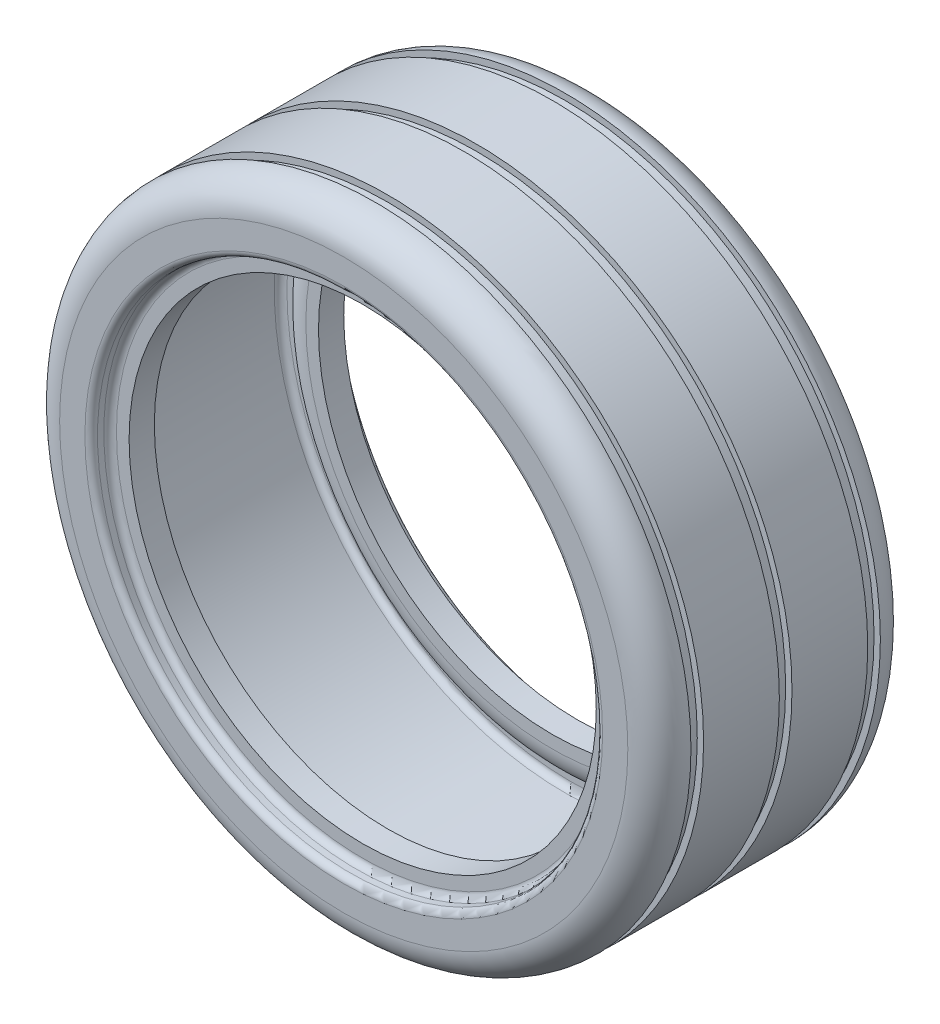
ISO-10303-21;
HEADER;
FILE_DESCRIPTION(('STEP AP214'),'2;1');
FILE_NAME('part.step','',(''),(''),'','','');
FILE_SCHEMA(('AUTOMOTIVE_DESIGN { 1 0 10303 214 1 1 1 1 }'));
ENDSEC;
DATA;
#1=APPLICATION_CONTEXT('core data for automotive mechanical design processes');
#2=APPLICATION_PROTOCOL_DEFINITION('international standard','automotive_design',2000,#1);
#3=PRODUCT_CONTEXT('',#1,'mechanical');
#4=PRODUCT('Part','Part','',(#3));
#5=PRODUCT_RELATED_PRODUCT_CATEGORY('part','',(#4));
#6=PRODUCT_DEFINITION_FORMATION('','',#4);
#7=PRODUCT_DEFINITION_CONTEXT('part definition',#1,'design');
#8=PRODUCT_DEFINITION('design','',#6,#7);
#9=PRODUCT_DEFINITION_SHAPE('','',#8);
#10=(LENGTH_UNIT() NAMED_UNIT(*) SI_UNIT(.MILLI.,.METRE.));
#11=(NAMED_UNIT(*) PLANE_ANGLE_UNIT() SI_UNIT($,.RADIAN.));
#12=(NAMED_UNIT(*) SI_UNIT($,.STERADIAN.) SOLID_ANGLE_UNIT());
#13=UNCERTAINTY_MEASURE_WITH_UNIT(LENGTH_MEASURE(1.E-05),#10,'distance_accuracy_value','');
#14=(GEOMETRIC_REPRESENTATION_CONTEXT(3) GLOBAL_UNCERTAINTY_ASSIGNED_CONTEXT((#13)) GLOBAL_UNIT_ASSIGNED_CONTEXT((#10,
#11,#12)) REPRESENTATION_CONTEXT('',''));
#15=CARTESIAN_POINT('',(0.,0.,0.));
#16=DIRECTION('',(0.,0.,1.));
#17=DIRECTION('',(1.,0.,0.));
#18=AXIS2_PLACEMENT_3D('',#15,#16,#17);
#19=CARTESIAN_POINT('',(0.,80.,-19.));
#20=DIRECTION('',(0.,0.,1.));
#21=DIRECTION('',(1.,0.,0.));
#22=AXIS2_PLACEMENT_3D('',#19,#20,#21);
#23=TOROIDAL_SURFACE('',#22,41.,1.);
#24=CARTESIAN_POINT('',(0.,80.,-20.));
#25=DIRECTION('',(0.,0.,1.));
#26=DIRECTION('',(1.,0.,0.));
#27=AXIS2_PLACEMENT_3D('',#24,#25,#26);
#28=CIRCLE('',#27,41.);
#29=CARTESIAN_POINT('',(41.,80.,-20.));
#30=VERTEX_POINT('',#29);
#31=EDGE_CURVE('E10',#30,#30,#28,.T.);
#32=ORIENTED_EDGE('',*,*,#31,.F.);
#33=EDGE_LOOP('',(#32));
#34=FACE_BOUND('',#33,.T.);
#35=CARTESIAN_POINT('',(0.,80.,-19.));
#36=DIRECTION('',(0.,0.,1.));
#37=DIRECTION('',(1.,0.,0.));
#38=AXIS2_PLACEMENT_3D('',#35,#36,#37);
#39=CIRCLE('',#38,40.);
#40=CARTESIAN_POINT('',(40.,80.,-19.));
#41=VERTEX_POINT('',#40);
#42=EDGE_CURVE('E67',#41,#41,#39,.T.);
#43=ORIENTED_EDGE('',*,*,#42,.T.);
#44=EDGE_LOOP('',(#43));
#45=FACE_BOUND('',#44,.T.);
#46=ADVANCED_FACE('F35',(#34,#45),#23,.T.);
#47=CARTESIAN_POINT('',(0.,125.,-20.));
#48=DIRECTION('',(0.,0.,1.));
#49=DIRECTION('',(1.,0.,0.));
#50=AXIS2_PLACEMENT_3D('',#47,#48,#49);
#51=PLANE('',#50);
#52=CARTESIAN_POINT('',(0.,80.,-20.));
#53=DIRECTION('',(0.,0.,1.));
#54=DIRECTION('',(1.,0.,0.));
#55=AXIS2_PLACEMENT_3D('',#52,#53,#54);
#56=CIRCLE('',#55,45.);
#57=CARTESIAN_POINT('',(45.,80.,-20.));
#58=VERTEX_POINT('',#57);
#59=EDGE_CURVE('E42',#58,#58,#56,.T.);
#60=ORIENTED_EDGE('',*,*,#59,.F.);
#61=EDGE_LOOP('',(#60));
#62=FACE_BOUND('',#61,.T.);
#63=ORIENTED_EDGE('',*,*,#31,.T.);
#64=EDGE_LOOP('',(#63));
#65=FACE_BOUND('',#64,.T.);
#66=ADVANCED_FACE('F190',(#62,#65),#51,.F.);
#67=CARTESIAN_POINT('',(0.,80.,-15.));
#68=DIRECTION('',(0.,0.,1.));
#69=DIRECTION('',(1.,0.,0.));
#70=AXIS2_PLACEMENT_3D('',#67,#68,#69);
#71=TOROIDAL_SURFACE('',#70,45.,5.);
#72=CARTESIAN_POINT('',(0.,80.,-15.));
#73=DIRECTION('',(0.,0.,-1.));
#74=DIRECTION('',(-1.,0.,0.));
#75=AXIS2_PLACEMENT_3D('',#72,#73,#74);
#76=CIRCLE('',#75,50.);
#77=CARTESIAN_POINT('',(-50.,80.,-15.));
#78=VERTEX_POINT('',#77);
#79=EDGE_CURVE('E59',#78,#78,#76,.T.);
#80=ORIENTED_EDGE('',*,*,#79,.T.);
#81=EDGE_LOOP('',(#80));
#82=FACE_BOUND('',#81,.T.);
#83=ORIENTED_EDGE('',*,*,#59,.T.);
#84=EDGE_LOOP('',(#83));
#85=FACE_BOUND('',#84,.T.);
#86=ADVANCED_FACE('F134',(#82,#85),#71,.T.);
#87=CARTESIAN_POINT('',(0.,80.,15.));
#88=DIRECTION('',(0.,0.,1.));
#89=DIRECTION('',(1.,0.,0.));
#90=AXIS2_PLACEMENT_3D('',#87,#88,#89);
#91=TOROIDAL_SURFACE('',#90,45.,5.);
#92=CARTESIAN_POINT('',(0.,80.,20.));
#93=DIRECTION('',(0.,0.,1.));
#94=DIRECTION('',(1.,0.,0.));
#95=AXIS2_PLACEMENT_3D('',#92,#93,#94);
#96=CIRCLE('',#95,45.);
#97=CARTESIAN_POINT('',(45.,80.,20.));
#98=VERTEX_POINT('',#97);
#99=EDGE_CURVE('E47',#98,#98,#96,.T.);
#100=ORIENTED_EDGE('',*,*,#99,.F.);
#101=EDGE_LOOP('',(#100));
#102=FACE_BOUND('',#101,.T.);
#103=CARTESIAN_POINT('',(0.,80.,15.));
#104=DIRECTION('',(0.,0.,1.));
#105=DIRECTION('',(1.,0.,0.));
#106=AXIS2_PLACEMENT_3D('',#103,#104,#105);
#107=CIRCLE('',#106,50.);
#108=CARTESIAN_POINT('',(50.,80.,15.));
#109=VERTEX_POINT('',#108);
#110=EDGE_CURVE('E55',#109,#109,#107,.T.);
#111=ORIENTED_EDGE('',*,*,#110,.T.);
#112=EDGE_LOOP('',(#111));
#113=FACE_BOUND('',#112,.T.);
#114=ADVANCED_FACE('F131',(#102,#113),#91,.T.);
#115=CARTESIAN_POINT('',(0.,125.,20.));
#116=DIRECTION('',(0.,0.,-1.));
#117=DIRECTION('',(-1.,0.,0.));
#118=AXIS2_PLACEMENT_3D('',#115,#116,#117);
#119=PLANE('',#118);
#120=CARTESIAN_POINT('',(0.,80.,20.));
#121=DIRECTION('',(0.,0.,1.));
#122=DIRECTION('',(1.,0.,0.));
#123=AXIS2_PLACEMENT_3D('',#120,#121,#122);
#124=CIRCLE('',#123,41.);
#125=CARTESIAN_POINT('',(41.,80.,20.));
#126=VERTEX_POINT('',#125);
#127=EDGE_CURVE('E124',#126,#126,#124,.T.);
#128=ORIENTED_EDGE('',*,*,#127,.F.);
#129=EDGE_LOOP('',(#128));
#130=FACE_BOUND('',#129,.T.);
#131=ORIENTED_EDGE('',*,*,#99,.T.);
#132=EDGE_LOOP('',(#131));
#133=FACE_BOUND('',#132,.T.);
#134=ADVANCED_FACE('F129',(#130,#133),#119,.F.);
#135=CARTESIAN_POINT('',(0.,80.,19.));
#136=DIRECTION('',(0.,0.,1.));
#137=DIRECTION('',(1.,0.,0.));
#138=AXIS2_PLACEMENT_3D('',#135,#136,#137);
#139=TOROIDAL_SURFACE('',#138,41.,1.);
#140=CARTESIAN_POINT('',(0.,80.,19.));
#141=DIRECTION('',(0.,0.,1.));
#142=DIRECTION('',(1.,0.,0.));
#143=AXIS2_PLACEMENT_3D('',#140,#141,#142);
#144=CIRCLE('',#143,40.);
#145=CARTESIAN_POINT('',(40.,80.,19.));
#146=VERTEX_POINT('',#145);
#147=EDGE_CURVE('E121',#146,#146,#144,.T.);
#148=ORIENTED_EDGE('',*,*,#147,.F.);
#149=EDGE_LOOP('',(#148));
#150=FACE_BOUND('',#149,.T.);
#151=ORIENTED_EDGE('',*,*,#127,.T.);
#152=EDGE_LOOP('',(#151));
#153=FACE_BOUND('',#152,.T.);
#154=ADVANCED_FACE('F299',(#150,#153),#139,.T.);
#155=CARTESIAN_POINT('',(0.,80.,0.));
#156=DIRECTION('',(0.,0.,1.));
#157=DIRECTION('',(1.,0.,0.));
#158=AXIS2_PLACEMENT_3D('',#155,#156,#157);
#159=CYLINDRICAL_SURFACE('',#158,40.);
#160=CARTESIAN_POINT('',(0.,80.,18.));
#161=DIRECTION('',(0.,0.,1.));
#162=DIRECTION('',(1.,0.,0.));
#163=AXIS2_PLACEMENT_3D('',#160,#161,#162);
#164=CIRCLE('',#163,40.);
#165=CARTESIAN_POINT('',(40.,80.,18.));
#166=VERTEX_POINT('',#165);
#167=EDGE_CURVE('E118',#166,#166,#164,.T.);
#168=ORIENTED_EDGE('',*,*,#167,.F.);
#169=EDGE_LOOP('',(#168));
#170=FACE_BOUND('',#169,.T.);
#171=ORIENTED_EDGE('',*,*,#147,.T.);
#172=EDGE_LOOP('',(#171));
#173=FACE_BOUND('',#172,.T.);
#174=ADVANCED_FACE('F293',(#170,#173),#159,.F.);
#175=CARTESIAN_POINT('',(0.,80.,18.));
#176=DIRECTION('',(0.,0.,1.));
#177=DIRECTION('',(1.,0.,0.));
#178=AXIS2_PLACEMENT_3D('',#175,#176,#177);
#179=TOROIDAL_SURFACE('',#178,39.,1.);
#180=CARTESIAN_POINT('',(0.,80.,17.));
#181=DIRECTION('',(0.,0.,1.));
#182=DIRECTION('',(1.,0.,0.));
#183=AXIS2_PLACEMENT_3D('',#180,#181,#182);
#184=CIRCLE('',#183,39.);
#185=CARTESIAN_POINT('',(39.,80.,17.));
#186=VERTEX_POINT('',#185);
#187=EDGE_CURVE('E115',#186,#186,#184,.T.);
#188=ORIENTED_EDGE('',*,*,#187,.F.);
#189=EDGE_LOOP('',(#188));
#190=FACE_BOUND('',#189,.T.);
#191=ORIENTED_EDGE('',*,*,#167,.T.);
#192=EDGE_LOOP('',(#191));
#193=FACE_BOUND('',#192,.T.);
#194=ADVANCED_FACE('F287',(#190,#193),#179,.F.);
#195=CARTESIAN_POINT('',(0.,119.,17.));
#196=DIRECTION('',(0.,0.,-1.));
#197=DIRECTION('',(-1.,0.,0.));
#198=AXIS2_PLACEMENT_3D('',#195,#196,#197);
#199=PLANE('',#198);
#200=CARTESIAN_POINT('',(0.,80.,17.));
#201=DIRECTION('',(0.,0.,1.));
#202=DIRECTION('',(1.,0.,0.));
#203=AXIS2_PLACEMENT_3D('',#200,#201,#202);
#204=CIRCLE('',#203,37.);
#205=CARTESIAN_POINT('',(37.,80.,17.));
#206=VERTEX_POINT('',#205);
#207=EDGE_CURVE('E112',#206,#206,#204,.T.);
#208=ORIENTED_EDGE('',*,*,#207,.F.);
#209=EDGE_LOOP('',(#208));
#210=FACE_BOUND('',#209,.T.);
#211=ORIENTED_EDGE('',*,*,#187,.T.);
#212=EDGE_LOOP('',(#211));
#213=FACE_BOUND('',#212,.T.);
#214=ADVANCED_FACE('F281',(#210,#213),#199,.F.);
#215=CARTESIAN_POINT('',(0.,80.,0.));
#216=DIRECTION('',(0.,0.,1.));
#217=DIRECTION('',(1.,0.,0.));
#218=AXIS2_PLACEMENT_3D('',#215,#216,#217);
#219=CYLINDRICAL_SURFACE('',#218,37.);
#220=CARTESIAN_POINT('',(0.,80.,13.));
#221=DIRECTION('',(0.,0.,1.));
#222=DIRECTION('',(1.,0.,0.));
#223=AXIS2_PLACEMENT_3D('',#220,#221,#222);
#224=CIRCLE('',#223,37.);
#225=CARTESIAN_POINT('',(37.,80.,13.));
#226=VERTEX_POINT('',#225);
#227=EDGE_CURVE('E109',#226,#226,#224,.T.);
#228=ORIENTED_EDGE('',*,*,#227,.F.);
#229=EDGE_LOOP('',(#228));
#230=FACE_BOUND('',#229,.T.);
#231=ORIENTED_EDGE('',*,*,#207,.T.);
#232=EDGE_LOOP('',(#231));
#233=FACE_BOUND('',#232,.T.);
#234=ADVANCED_FACE('F275',(#230,#233),#219,.F.);
#235=CARTESIAN_POINT('',(0.,119.,13.));
#236=DIRECTION('',(0.,0.,1.));
#237=DIRECTION('',(1.,0.,0.));
#238=AXIS2_PLACEMENT_3D('',#235,#236,#237);
#239=PLANE('',#238);
#240=CARTESIAN_POINT('',(0.,80.,13.));
#241=DIRECTION('',(0.,0.,1.));
#242=DIRECTION('',(1.,0.,0.));
#243=AXIS2_PLACEMENT_3D('',#240,#241,#242);
#244=CIRCLE('',#243,39.);
#245=CARTESIAN_POINT('',(39.,80.,13.));
#246=VERTEX_POINT('',#245);
#247=EDGE_CURVE('E106',#246,#246,#244,.T.);
#248=ORIENTED_EDGE('',*,*,#247,.F.);
#249=EDGE_LOOP('',(#248));
#250=FACE_BOUND('',#249,.T.);
#251=ORIENTED_EDGE('',*,*,#227,.T.);
#252=EDGE_LOOP('',(#251));
#253=FACE_BOUND('',#252,.T.);
#254=ADVANCED_FACE('F269',(#250,#253),#239,.F.);
#255=CARTESIAN_POINT('',(0.,80.,18.));
#256=DIRECTION('',(0.,0.,1.));
#257=DIRECTION('',(1.,0.,0.));
#258=AXIS2_PLACEMENT_3D('',#255,#256,#257);
#259=TOROIDAL_SURFACE('',#258,39.,5.);
#260=CARTESIAN_POINT('',(0.,80.,16.));
#261=DIRECTION('',(0.,0.,1.));
#262=DIRECTION('',(1.,0.,0.));
#263=AXIS2_PLACEMENT_3D('',#260,#261,#262);
#264=CIRCLE('',#263,43.5825756949558);
#265=CARTESIAN_POINT('',(43.5825756949558,80.,16.));
#266=VERTEX_POINT('',#265);
#267=EDGE_CURVE('E103',#266,#266,#264,.T.);
#268=ORIENTED_EDGE('',*,*,#267,.F.);
#269=EDGE_LOOP('',(#268));
#270=FACE_BOUND('',#269,.T.);
#271=ORIENTED_EDGE('',*,*,#247,.T.);
#272=EDGE_LOOP('',(#271));
#273=FACE_BOUND('',#272,.T.);
#274=ADVANCED_FACE('F263',(#270,#273),#259,.T.);
#275=CARTESIAN_POINT('',(0.,125.,16.));
#276=DIRECTION('',(0.,0.,1.));
#277=DIRECTION('',(1.,0.,0.));
#278=AXIS2_PLACEMENT_3D('',#275,#276,#277);
#279=PLANE('',#278);
#280=CARTESIAN_POINT('',(0.,80.,16.));
#281=DIRECTION('',(0.,0.,1.));
#282=DIRECTION('',(1.,0.,0.));
#283=AXIS2_PLACEMENT_3D('',#280,#281,#282);
#284=CIRCLE('',#283,45.);
#285=CARTESIAN_POINT('',(45.,80.,16.));
#286=VERTEX_POINT('',#285);
#287=EDGE_CURVE('E100',#286,#286,#284,.T.);
#288=ORIENTED_EDGE('',*,*,#287,.F.);
#289=EDGE_LOOP('',(#288));
#290=FACE_BOUND('',#289,.T.);
#291=ORIENTED_EDGE('',*,*,#267,.T.);
#292=EDGE_LOOP('',(#291));
#293=FACE_BOUND('',#292,.T.);
#294=ADVANCED_FACE('F257',(#290,#293),#279,.F.);
#295=CARTESIAN_POINT('',(0.,80.,15.));
#296=DIRECTION('',(0.,0.,1.));
#297=DIRECTION('',(1.,0.,0.));
#298=AXIS2_PLACEMENT_3D('',#295,#296,#297);
#299=TOROIDAL_SURFACE('',#298,45.,1.);
#300=CARTESIAN_POINT('',(0.,80.,15.));
#301=DIRECTION('',(0.,0.,1.));
#302=DIRECTION('',(1.,0.,0.));
#303=AXIS2_PLACEMENT_3D('',#300,#301,#302);
#304=CIRCLE('',#303,46.);
#305=CARTESIAN_POINT('',(46.,80.,15.));
#306=VERTEX_POINT('',#305);
#307=EDGE_CURVE('E97',#306,#306,#304,.T.);
#308=ORIENTED_EDGE('',*,*,#307,.F.);
#309=EDGE_LOOP('',(#308));
#310=FACE_BOUND('',#309,.T.);
#311=ORIENTED_EDGE('',*,*,#287,.T.);
#312=EDGE_LOOP('',(#311));
#313=FACE_BOUND('',#312,.T.);
#314=ADVANCED_FACE('F251',(#310,#313),#299,.F.);
#315=CARTESIAN_POINT('',(0.,80.,0.));
#316=DIRECTION('',(0.,0.,1.));
#317=DIRECTION('',(1.,0.,0.));
#318=AXIS2_PLACEMENT_3D('',#315,#316,#317);
#319=CYLINDRICAL_SURFACE('',#318,46.);
#320=CARTESIAN_POINT('',(0.,80.,-15.));
#321=DIRECTION('',(0.,0.,1.));
#322=DIRECTION('',(1.,0.,0.));
#323=AXIS2_PLACEMENT_3D('',#320,#321,#322);
#324=CIRCLE('',#323,46.);
#325=CARTESIAN_POINT('',(46.,80.,-15.));
#326=VERTEX_POINT('',#325);
#327=EDGE_CURVE('E94',#326,#326,#324,.T.);
#328=ORIENTED_EDGE('',*,*,#327,.F.);
#329=EDGE_LOOP('',(#328));
#330=FACE_BOUND('',#329,.T.);
#331=ORIENTED_EDGE('',*,*,#307,.T.);
#332=EDGE_LOOP('',(#331));
#333=FACE_BOUND('',#332,.T.);
#334=ADVANCED_FACE('F245',(#330,#333),#319,.F.);
#335=CARTESIAN_POINT('',(0.,80.,-15.));
#336=DIRECTION('',(0.,0.,1.));
#337=DIRECTION('',(1.,0.,0.));
#338=AXIS2_PLACEMENT_3D('',#335,#336,#337);
#339=TOROIDAL_SURFACE('',#338,45.,1.);
#340=CARTESIAN_POINT('',(0.,80.,-16.));
#341=DIRECTION('',(0.,0.,1.));
#342=DIRECTION('',(1.,0.,0.));
#343=AXIS2_PLACEMENT_3D('',#340,#341,#342);
#344=CIRCLE('',#343,45.);
#345=CARTESIAN_POINT('',(45.,80.,-16.));
#346=VERTEX_POINT('',#345);
#347=EDGE_CURVE('E91',#346,#346,#344,.T.);
#348=ORIENTED_EDGE('',*,*,#347,.F.);
#349=EDGE_LOOP('',(#348));
#350=FACE_BOUND('',#349,.T.);
#351=ORIENTED_EDGE('',*,*,#327,.T.);
#352=EDGE_LOOP('',(#351));
#353=FACE_BOUND('',#352,.T.);
#354=ADVANCED_FACE('F239',(#350,#353),#339,.F.);
#355=CARTESIAN_POINT('',(0.,125.,-16.));
#356=DIRECTION('',(0.,0.,-1.));
#357=DIRECTION('',(-1.,0.,0.));
#358=AXIS2_PLACEMENT_3D('',#355,#356,#357);
#359=PLANE('',#358);
#360=CARTESIAN_POINT('',(0.,80.,-16.));
#361=DIRECTION('',(0.,0.,1.));
#362=DIRECTION('',(1.,0.,0.));
#363=AXIS2_PLACEMENT_3D('',#360,#361,#362);
#364=CIRCLE('',#363,43.5825756949558);
#365=CARTESIAN_POINT('',(43.5825756949558,80.,-16.));
#366=VERTEX_POINT('',#365);
#367=EDGE_CURVE('E88',#366,#366,#364,.T.);
#368=ORIENTED_EDGE('',*,*,#367,.F.);
#369=EDGE_LOOP('',(#368));
#370=FACE_BOUND('',#369,.T.);
#371=ORIENTED_EDGE('',*,*,#347,.T.);
#372=EDGE_LOOP('',(#371));
#373=FACE_BOUND('',#372,.T.);
#374=ADVANCED_FACE('F233',(#370,#373),#359,.F.);
#375=CARTESIAN_POINT('',(0.,80.,-18.));
#376=DIRECTION('',(0.,0.,1.));
#377=DIRECTION('',(1.,0.,0.));
#378=AXIS2_PLACEMENT_3D('',#375,#376,#377);
#379=TOROIDAL_SURFACE('',#378,39.,5.);
#380=CARTESIAN_POINT('',(0.,80.,-13.));
#381=DIRECTION('',(0.,0.,1.));
#382=DIRECTION('',(1.,0.,0.));
#383=AXIS2_PLACEMENT_3D('',#380,#381,#382);
#384=CIRCLE('',#383,39.);
#385=CARTESIAN_POINT('',(39.,80.,-13.));
#386=VERTEX_POINT('',#385);
#387=EDGE_CURVE('E85',#386,#386,#384,.T.);
#388=ORIENTED_EDGE('',*,*,#387,.F.);
#389=EDGE_LOOP('',(#388));
#390=FACE_BOUND('',#389,.T.);
#391=ORIENTED_EDGE('',*,*,#367,.T.);
#392=EDGE_LOOP('',(#391));
#393=FACE_BOUND('',#392,.T.);
#394=ADVANCED_FACE('F227',(#390,#393),#379,.T.);
#395=CARTESIAN_POINT('',(0.,119.,-13.));
#396=DIRECTION('',(0.,0.,-1.));
#397=DIRECTION('',(-1.,0.,0.));
#398=AXIS2_PLACEMENT_3D('',#395,#396,#397);
#399=PLANE('',#398);
#400=CARTESIAN_POINT('',(0.,80.,-13.));
#401=DIRECTION('',(0.,0.,1.));
#402=DIRECTION('',(1.,0.,0.));
#403=AXIS2_PLACEMENT_3D('',#400,#401,#402);
#404=CIRCLE('',#403,37.);
#405=CARTESIAN_POINT('',(37.,80.,-13.));
#406=VERTEX_POINT('',#405);
#407=EDGE_CURVE('E82',#406,#406,#404,.T.);
#408=ORIENTED_EDGE('',*,*,#407,.F.);
#409=EDGE_LOOP('',(#408));
#410=FACE_BOUND('',#409,.T.);
#411=ORIENTED_EDGE('',*,*,#387,.T.);
#412=EDGE_LOOP('',(#411));
#413=FACE_BOUND('',#412,.T.);
#414=ADVANCED_FACE('F221',(#410,#413),#399,.F.);
#415=CARTESIAN_POINT('',(0.,80.,0.));
#416=DIRECTION('',(0.,0.,1.));
#417=DIRECTION('',(1.,0.,0.));
#418=AXIS2_PLACEMENT_3D('',#415,#416,#417);
#419=CYLINDRICAL_SURFACE('',#418,37.);
#420=CARTESIAN_POINT('',(0.,80.,-17.));
#421=DIRECTION('',(0.,0.,1.));
#422=DIRECTION('',(1.,0.,0.));
#423=AXIS2_PLACEMENT_3D('',#420,#421,#422);
#424=CIRCLE('',#423,37.);
#425=CARTESIAN_POINT('',(37.,80.,-17.));
#426=VERTEX_POINT('',#425);
#427=EDGE_CURVE('E79',#426,#426,#424,.T.);
#428=ORIENTED_EDGE('',*,*,#427,.F.);
#429=EDGE_LOOP('',(#428));
#430=FACE_BOUND('',#429,.T.);
#431=ORIENTED_EDGE('',*,*,#407,.T.);
#432=EDGE_LOOP('',(#431));
#433=FACE_BOUND('',#432,.T.);
#434=ADVANCED_FACE('F215',(#430,#433),#419,.F.);
#435=CARTESIAN_POINT('',(0.,119.,-17.));
#436=DIRECTION('',(0.,0.,1.));
#437=DIRECTION('',(1.,0.,0.));
#438=AXIS2_PLACEMENT_3D('',#435,#436,#437);
#439=PLANE('',#438);
#440=CARTESIAN_POINT('',(0.,80.,-17.));
#441=DIRECTION('',(0.,0.,1.));
#442=DIRECTION('',(1.,0.,0.));
#443=AXIS2_PLACEMENT_3D('',#440,#441,#442);
#444=CIRCLE('',#443,39.);
#445=CARTESIAN_POINT('',(39.,80.,-17.));
#446=VERTEX_POINT('',#445);
#447=EDGE_CURVE('E76',#446,#446,#444,.T.);
#448=ORIENTED_EDGE('',*,*,#447,.F.);
#449=EDGE_LOOP('',(#448));
#450=FACE_BOUND('',#449,.T.);
#451=ORIENTED_EDGE('',*,*,#427,.T.);
#452=EDGE_LOOP('',(#451));
#453=FACE_BOUND('',#452,.T.);
#454=ADVANCED_FACE('F209',(#450,#453),#439,.F.);
#455=CARTESIAN_POINT('',(0.,80.,-18.));
#456=DIRECTION('',(0.,0.,1.));
#457=DIRECTION('',(1.,0.,0.));
#458=AXIS2_PLACEMENT_3D('',#455,#456,#457);
#459=TOROIDAL_SURFACE('',#458,39.,1.);
#460=CARTESIAN_POINT('',(0.,80.,-18.));
#461=DIRECTION('',(0.,0.,1.));
#462=DIRECTION('',(1.,0.,0.));
#463=AXIS2_PLACEMENT_3D('',#460,#461,#462);
#464=CIRCLE('',#463,40.);
#465=CARTESIAN_POINT('',(40.,80.,-18.));
#466=VERTEX_POINT('',#465);
#467=EDGE_CURVE('E73',#466,#466,#464,.T.);
#468=ORIENTED_EDGE('',*,*,#467,.F.);
#469=EDGE_LOOP('',(#468));
#470=FACE_BOUND('',#469,.T.);
#471=ORIENTED_EDGE('',*,*,#447,.T.);
#472=EDGE_LOOP('',(#471));
#473=FACE_BOUND('',#472,.T.);
#474=ADVANCED_FACE('F203',(#470,#473),#459,.F.);
#475=CARTESIAN_POINT('',(0.,80.,0.));
#476=DIRECTION('',(0.,0.,1.));
#477=DIRECTION('',(1.,0.,0.));
#478=AXIS2_PLACEMENT_3D('',#475,#476,#477);
#479=CYLINDRICAL_SURFACE('',#478,40.);
#480=ORIENTED_EDGE('',*,*,#42,.F.);
#481=EDGE_LOOP('',(#480));
#482=FACE_BOUND('',#481,.T.);
#483=ORIENTED_EDGE('',*,*,#467,.T.);
#484=EDGE_LOOP('',(#483));
#485=FACE_BOUND('',#484,.T.);
#486=ADVANCED_FACE('F199',(#482,#485),#479,.F.);
#487=CARTESIAN_POINT('',(0.,142.18202290067,13.));
#488=DIRECTION('',(0.,0.,-1.));
#489=DIRECTION('',(-1.,0.,0.));
#490=AXIS2_PLACEMENT_3D('',#487,#488,#489);
#491=PLANE('',#490);
#492=CARTESIAN_POINT('',(0.,80.,13.));
#493=DIRECTION('',(0.,0.,-1.));
#494=DIRECTION('',(-1.,0.,0.));
#495=AXIS2_PLACEMENT_3D('',#492,#493,#494);
#496=CIRCLE('',#495,49.);
#497=CARTESIAN_POINT('',(-49.,80.,13.));
#498=VERTEX_POINT('',#497);
#499=EDGE_CURVE('E146',#498,#498,#496,.T.);
#500=ORIENTED_EDGE('',*,*,#499,.T.);
#501=EDGE_LOOP('',(#500));
#502=FACE_BOUND('',#501,.T.);
#503=CARTESIAN_POINT('',(0.,80.,13.));
#504=DIRECTION('',(0.,0.,-1.));
#505=DIRECTION('',(-1.,0.,0.));
#506=AXIS2_PLACEMENT_3D('',#503,#504,#505);
#507=CIRCLE('',#506,50.);
#508=CARTESIAN_POINT('',(-50.,80.,13.));
#509=VERTEX_POINT('',#508);
#510=EDGE_CURVE('E57',#509,#509,#507,.T.);
#511=ORIENTED_EDGE('',*,*,#510,.F.);
#512=EDGE_LOOP('',(#511));
#513=FACE_BOUND('',#512,.T.);
#514=ADVANCED_FACE('F202',(#502,#513),#491,.F.);
#515=CARTESIAN_POINT('',(0.,142.18202290067,15.));
#516=DIRECTION('',(0.,0.,1.));
#517=DIRECTION('',(1.,0.,0.));
#518=AXIS2_PLACEMENT_3D('',#515,#516,#517);
#519=PLANE('',#518);
#520=CARTESIAN_POINT('',(0.,80.,15.));
#521=DIRECTION('',(0.,0.,-1.));
#522=DIRECTION('',(-1.,0.,0.));
#523=AXIS2_PLACEMENT_3D('',#520,#521,#522);
#524=CIRCLE('',#523,49.);
#525=CARTESIAN_POINT('',(-49.,80.,15.));
#526=VERTEX_POINT('',#525);
#527=EDGE_CURVE('E149',#526,#526,#524,.T.);
#528=ORIENTED_EDGE('',*,*,#527,.F.);
#529=EDGE_LOOP('',(#528));
#530=FACE_BOUND('',#529,.T.);
#531=ORIENTED_EDGE('',*,*,#110,.F.);
#532=EDGE_LOOP('',(#531));
#533=FACE_BOUND('',#532,.T.);
#534=ADVANCED_FACE('F182',(#530,#533),#519,.F.);
#535=CARTESIAN_POINT('',(0.,80.,-15.));
#536=DIRECTION('',(0.,0.,-1.));
#537=DIRECTION('',(-1.,0.,0.));
#538=AXIS2_PLACEMENT_3D('',#535,#536,#537);
#539=CYLINDRICAL_SURFACE('',#538,49.);
#540=ORIENTED_EDGE('',*,*,#499,.F.);
#541=EDGE_LOOP('',(#540));
#542=FACE_BOUND('',#541,.T.);
#543=ORIENTED_EDGE('',*,*,#527,.T.);
#544=EDGE_LOOP('',(#543));
#545=FACE_BOUND('',#544,.T.);
#546=ADVANCED_FACE('F173',(#542,#545),#539,.T.);
#547=CARTESIAN_POINT('',(0.,80.,0.));
#548=DIRECTION('',(0.,0.,1.));
#549=DIRECTION('',(1.,0.,0.));
#550=AXIS2_PLACEMENT_3D('',#547,#548,#549);
#551=CYLINDRICAL_SURFACE('',#550,50.);
#552=ORIENTED_EDGE('',*,*,#510,.T.);
#553=EDGE_LOOP('',(#552));
#554=FACE_BOUND('',#553,.T.);
#555=CARTESIAN_POINT('',(0.,80.,1.00000000000001));
#556=DIRECTION('',(0.,0.,1.));
#557=DIRECTION('',(1.,0.,0.));
#558=AXIS2_PLACEMENT_3D('',#555,#556,#557);
#559=CIRCLE('',#558,50.);
#560=CARTESIAN_POINT('',(50.,80.,1.00000000000001));
#561=VERTEX_POINT('',#560);
#562=EDGE_CURVE('E54',#561,#561,#559,.T.);
#563=ORIENTED_EDGE('',*,*,#562,.T.);
#564=EDGE_LOOP('',(#563));
#565=FACE_BOUND('',#564,.T.);
#566=ADVANCED_FACE('F170',(#554,#565),#551,.T.);
#567=CARTESIAN_POINT('',(0.,142.18202290067,-13.));
#568=DIRECTION('',(0.,0.,1.));
#569=DIRECTION('',(1.,0.,0.));
#570=AXIS2_PLACEMENT_3D('',#567,#568,#569);
#571=PLANE('',#570);
#572=CARTESIAN_POINT('',(0.,80.,-13.));
#573=DIRECTION('',(0.,0.,-1.));
#574=DIRECTION('',(-1.,0.,0.));
#575=AXIS2_PLACEMENT_3D('',#572,#573,#574);
#576=CIRCLE('',#575,49.);
#577=CARTESIAN_POINT('',(-49.,80.,-13.));
#578=VERTEX_POINT('',#577);
#579=EDGE_CURVE('E139',#578,#578,#576,.T.);
#580=ORIENTED_EDGE('',*,*,#579,.F.);
#581=EDGE_LOOP('',(#580));
#582=FACE_BOUND('',#581,.T.);
#583=CARTESIAN_POINT('',(0.,80.,-13.));
#584=DIRECTION('',(0.,0.,1.));
#585=DIRECTION('',(1.,0.,0.));
#586=AXIS2_PLACEMENT_3D('',#583,#584,#585);
#587=CIRCLE('',#586,50.);
#588=CARTESIAN_POINT('',(50.,80.,-13.));
#589=VERTEX_POINT('',#588);
#590=EDGE_CURVE('E38',#589,#589,#587,.T.);
#591=ORIENTED_EDGE('',*,*,#590,.F.);
#592=EDGE_LOOP('',(#591));
#593=FACE_BOUND('',#592,.T.);
#594=ADVANCED_FACE('F172',(#582,#593),#571,.F.);
#595=CARTESIAN_POINT('',(0.,142.18202290067,-15.));
#596=DIRECTION('',(0.,0.,-1.));
#597=DIRECTION('',(-1.,0.,0.));
#598=AXIS2_PLACEMENT_3D('',#595,#596,#597);
#599=PLANE('',#598);
#600=CARTESIAN_POINT('',(0.,80.,-15.));
#601=DIRECTION('',(0.,0.,-1.));
#602=DIRECTION('',(-1.,0.,0.));
#603=AXIS2_PLACEMENT_3D('',#600,#601,#602);
#604=CIRCLE('',#603,49.);
#605=CARTESIAN_POINT('',(-49.,80.,-15.));
#606=VERTEX_POINT('',#605);
#607=EDGE_CURVE('E141',#606,#606,#604,.T.);
#608=ORIENTED_EDGE('',*,*,#607,.T.);
#609=EDGE_LOOP('',(#608));
#610=FACE_BOUND('',#609,.T.);
#611=ORIENTED_EDGE('',*,*,#79,.F.);
#612=EDGE_LOOP('',(#611));
#613=FACE_BOUND('',#612,.T.);
#614=ADVANCED_FACE('F179',(#610,#613),#599,.F.);
#615=CARTESIAN_POINT('',(0.,80.,-15.));
#616=DIRECTION('',(0.,0.,-1.));
#617=DIRECTION('',(-1.,0.,0.));
#618=AXIS2_PLACEMENT_3D('',#615,#616,#617);
#619=CYLINDRICAL_SURFACE('',#618,49.);
#620=ORIENTED_EDGE('',*,*,#607,.F.);
#621=EDGE_LOOP('',(#620));
#622=FACE_BOUND('',#621,.T.);
#623=ORIENTED_EDGE('',*,*,#579,.T.);
#624=EDGE_LOOP('',(#623));
#625=FACE_BOUND('',#624,.T.);
#626=ADVANCED_FACE('F187',(#622,#625),#619,.T.);
#627=ORIENTED_EDGE('',*,*,#590,.T.);
#628=EDGE_LOOP('',(#627));
#629=FACE_BOUND('',#628,.T.);
#630=CARTESIAN_POINT('',(0.,80.,-0.999999999999993));
#631=DIRECTION('',(0.,0.,-1.));
#632=DIRECTION('',(-1.,0.,0.));
#633=AXIS2_PLACEMENT_3D('',#630,#631,#632);
#634=CIRCLE('',#633,50.);
#635=CARTESIAN_POINT('',(-50.,80.,-0.999999999999993));
#636=VERTEX_POINT('',#635);
#637=EDGE_CURVE('E51',#636,#636,#634,.T.);
#638=ORIENTED_EDGE('',*,*,#637,.T.);
#639=EDGE_LOOP('',(#638));
#640=FACE_BOUND('',#639,.T.);
#641=ADVANCED_FACE('F166',(#629,#640),#551,.T.);
#642=CARTESIAN_POINT('',(0.,142.18202290067,1.00000000000001));
#643=DIRECTION('',(0.,0.,1.));
#644=DIRECTION('',(1.,0.,0.));
#645=AXIS2_PLACEMENT_3D('',#642,#643,#644);
#646=PLANE('',#645);
#647=CARTESIAN_POINT('',(0.,80.,1.00000000000001));
#648=DIRECTION('',(0.,0.,-1.));
#649=DIRECTION('',(-1.,0.,0.));
#650=AXIS2_PLACEMENT_3D('',#647,#648,#649);
#651=CIRCLE('',#650,49.);
#652=CARTESIAN_POINT('',(-49.,80.,1.00000000000001));
#653=VERTEX_POINT('',#652);
#654=EDGE_CURVE('E152',#653,#653,#651,.T.);
#655=ORIENTED_EDGE('',*,*,#654,.F.);
#656=EDGE_LOOP('',(#655));
#657=FACE_BOUND('',#656,.T.);
#658=ORIENTED_EDGE('',*,*,#562,.F.);
#659=EDGE_LOOP('',(#658));
#660=FACE_BOUND('',#659,.T.);
#661=ADVANCED_FACE('F162',(#657,#660),#646,.F.);
#662=CARTESIAN_POINT('',(0.,142.18202290067,-0.999999999999993));
#663=DIRECTION('',(0.,0.,-1.));
#664=DIRECTION('',(-1.,0.,0.));
#665=AXIS2_PLACEMENT_3D('',#662,#663,#664);
#666=PLANE('',#665);
#667=CARTESIAN_POINT('',(0.,80.,-0.999999999999993));
#668=DIRECTION('',(0.,0.,-1.));
#669=DIRECTION('',(-1.,0.,0.));
#670=AXIS2_PLACEMENT_3D('',#667,#668,#669);
#671=CIRCLE('',#670,49.);
#672=CARTESIAN_POINT('',(-49.,80.,-0.999999999999993));
#673=VERTEX_POINT('',#672);
#674=EDGE_CURVE('E155',#673,#673,#671,.T.);
#675=ORIENTED_EDGE('',*,*,#674,.T.);
#676=EDGE_LOOP('',(#675));
#677=FACE_BOUND('',#676,.T.);
#678=ORIENTED_EDGE('',*,*,#637,.F.);
#679=EDGE_LOOP('',(#678));
#680=FACE_BOUND('',#679,.T.);
#681=ADVANCED_FACE('F165',(#677,#680),#666,.F.);
#682=CARTESIAN_POINT('',(0.,80.,-15.));
#683=DIRECTION('',(0.,0.,-1.));
#684=DIRECTION('',(-1.,0.,0.));
#685=AXIS2_PLACEMENT_3D('',#682,#683,#684);
#686=CYLINDRICAL_SURFACE('',#685,49.);
#687=ORIENTED_EDGE('',*,*,#674,.F.);
#688=EDGE_LOOP('',(#687));
#689=FACE_BOUND('',#688,.T.);
#690=ORIENTED_EDGE('',*,*,#654,.T.);
#691=EDGE_LOOP('',(#690));
#692=FACE_BOUND('',#691,.T.);
#693=ADVANCED_FACE('F160',(#689,#692),#686,.T.);
#694=CLOSED_SHELL('',(#46,#66,#86,#114,#134,#154,#174,#194,#214,#234,#254,#274,#294,#314,#334,
#354,#374,#394,#414,#434,#454,#474,#486,#514,#534,#546,#566,#594,#614,#626,#641,#661,#681,#693));
#695=MANIFOLD_SOLID_BREP('B2',#694);
#696=ADVANCED_BREP_SHAPE_REPRESENTATION('',(#18,#695),#14);
#697=SHAPE_DEFINITION_REPRESENTATION(#9,#696);
ENDSEC;
END-ISO-10303-21;
